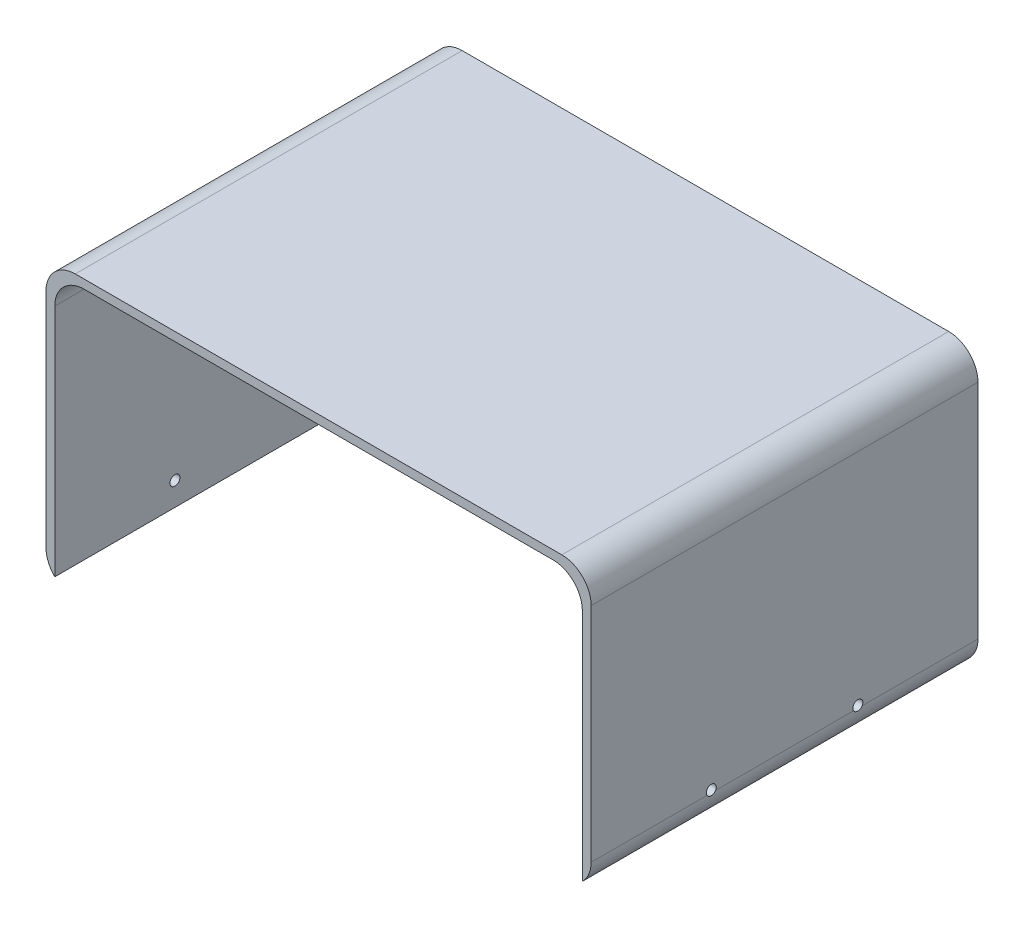
ISO-10303-21;
HEADER;
FILE_DESCRIPTION(('STEP AP214'),'2;1');
FILE_NAME('part.step','',(''),(''),'','','');
FILE_SCHEMA(('AUTOMOTIVE_DESIGN { 1 0 10303 214 1 1 1 1 }'));
ENDSEC;
DATA;
#1=APPLICATION_CONTEXT('core data for automotive mechanical design processes');
#2=APPLICATION_PROTOCOL_DEFINITION('international standard','automotive_design',2000,#1);
#3=PRODUCT_CONTEXT('',#1,'mechanical');
#4=PRODUCT('Part','Part','',(#3));
#5=PRODUCT_RELATED_PRODUCT_CATEGORY('part','',(#4));
#6=PRODUCT_DEFINITION_FORMATION('','',#4);
#7=PRODUCT_DEFINITION_CONTEXT('part definition',#1,'design');
#8=PRODUCT_DEFINITION('design','',#6,#7);
#9=PRODUCT_DEFINITION_SHAPE('','',#8);
#10=(LENGTH_UNIT() NAMED_UNIT(*) SI_UNIT(.MILLI.,.METRE.));
#11=(NAMED_UNIT(*) PLANE_ANGLE_UNIT() SI_UNIT($,.RADIAN.));
#12=(NAMED_UNIT(*) SI_UNIT($,.STERADIAN.) SOLID_ANGLE_UNIT());
#13=UNCERTAINTY_MEASURE_WITH_UNIT(LENGTH_MEASURE(1.E-05),#10,'distance_accuracy_value','');
#14=(GEOMETRIC_REPRESENTATION_CONTEXT(3) GLOBAL_UNCERTAINTY_ASSIGNED_CONTEXT((#13)) GLOBAL_UNIT_ASSIGNED_CONTEXT((#10,
#11,#12)) REPRESENTATION_CONTEXT('',''));
#15=CARTESIAN_POINT('',(0.,0.,0.));
#16=DIRECTION('',(0.,0.,1.));
#17=DIRECTION('',(1.,0.,0.));
#18=AXIS2_PLACEMENT_3D('',#15,#16,#17);
#19=CARTESIAN_POINT('',(0.,0.,0.));
#20=DIRECTION('',(1.,0.,0.));
#21=DIRECTION('',(0.,0.,-1.));
#22=AXIS2_PLACEMENT_3D('',#19,#20,#21);
#23=PLANE('',#22);
#24=CARTESIAN_POINT('',(0.,-85.,-91.));
#25=DIRECTION('',(1.,0.,0.));
#26=DIRECTION('',(0.,0.,-1.));
#27=AXIS2_PLACEMENT_3D('',#24,#25,#26);
#28=CIRCLE('',#27,1.70000000000001);
#29=CARTESIAN_POINT('',(0.,-85.,-92.7));
#30=VERTEX_POINT('',#29);
#31=EDGE_CURVE('E296',#30,#30,#28,.T.);
#32=ORIENTED_EDGE('',*,*,#31,.T.);
#33=EDGE_LOOP('',(#32));
#34=FACE_BOUND('',#33,.T.);
#35=CARTESIAN_POINT('',(0.,-85.,-41.));
#36=DIRECTION('',(1.,0.,0.));
#37=DIRECTION('',(0.,0.,-1.));
#38=AXIS2_PLACEMENT_3D('',#35,#36,#37);
#39=CIRCLE('',#38,1.7);
#40=CARTESIAN_POINT('',(0.,-85.,-42.7));
#41=VERTEX_POINT('',#40);
#42=EDGE_CURVE('E384',#41,#41,#39,.T.);
#43=ORIENTED_EDGE('',*,*,#42,.T.);
#44=EDGE_LOOP('',(#43));
#45=FACE_BOUND('',#44,.T.);
#46=DIRECTION('',(0.,-1.,0.));
#47=VECTOR('',#46,1.);
#48=CARTESIAN_POINT('',(0.,0.,0.));
#49=LINE('',#48,#47);
#50=CARTESIAN_POINT('',(0.,-13.,0.));
#51=VERTEX_POINT('',#50);
#52=CARTESIAN_POINT('',(0.,-93.,0.));
#53=VERTEX_POINT('',#52);
#54=EDGE_CURVE('E306',#51,#53,#49,.T.);
#55=ORIENTED_EDGE('',*,*,#54,.F.);
#56=DIRECTION('',(0.,0.,1.));
#57=VECTOR('',#56,1.);
#58=CARTESIAN_POINT('',(0.,-13.,-132.));
#59=LINE('',#58,#57);
#60=CARTESIAN_POINT('',(0.,-13.,-132.));
#61=VERTEX_POINT('',#60);
#62=EDGE_CURVE('E329',#51,#61,#59,.F.);
#63=ORIENTED_EDGE('',*,*,#62,.T.);
#64=DIRECTION('',(0.,1.,0.));
#65=VECTOR('',#64,1.);
#66=CARTESIAN_POINT('',(0.,0.,-132.));
#67=LINE('',#66,#65);
#68=CARTESIAN_POINT('',(0.,-93.,-132.));
#69=VERTEX_POINT('',#68);
#70=EDGE_CURVE('E311',#69,#61,#67,.T.);
#71=ORIENTED_EDGE('',*,*,#70,.F.);
#72=DIRECTION('',(0.,0.,-1.));
#73=VECTOR('',#72,1.);
#74=CARTESIAN_POINT('',(0.,-93.,0.));
#75=LINE('',#74,#73);
#76=EDGE_CURVE('E315',#53,#69,#75,.T.);
#77=ORIENTED_EDGE('',*,*,#76,.F.);
#78=EDGE_LOOP('',(#55,#63,#71,#77));
#79=FACE_BOUND('',#78,.T.);
#80=ADVANCED_FACE('F36',(#34,#45,#79),#23,.F.);
#81=CARTESIAN_POINT('',(3.,0.,0.));
#82=DIRECTION('',(0.,0.,-1.));
#83=DIRECTION('',(0.,1.,0.));
#84=AXIS2_PLACEMENT_3D('',#81,#82,#83);
#85=PLANE('',#84);
#86=ORIENTED_EDGE('',*,*,#54,.T.);
#87=CARTESIAN_POINT('',(-7.,-85.8585715714571,0.));
#88=DIRECTION('',(0.,0.,-1.));
#89=DIRECTION('',(0.,1.,0.));
#90=AXIS2_PLACEMENT_3D('',#87,#88,#89);
#91=CIRCLE('',#90,10.);
#92=CARTESIAN_POINT('',(3.,-85.8585715714571,0.));
#93=VERTEX_POINT('',#92);
#94=EDGE_CURVE('E173',#53,#93,#91,.F.);
#95=ORIENTED_EDGE('',*,*,#94,.T.);
#96=DIRECTION('',(0.,-1.,0.));
#97=VECTOR('',#96,1.);
#98=CARTESIAN_POINT('',(3.,0.,0.));
#99=LINE('',#98,#97);
#100=CARTESIAN_POINT('',(3.,-10.,0.));
#101=VERTEX_POINT('',#100);
#102=EDGE_CURVE('E307',#101,#93,#99,.T.);
#103=ORIENTED_EDGE('',*,*,#102,.F.);
#104=CARTESIAN_POINT('',(-7.,-10.,0.));
#105=DIRECTION('',(0.,0.,-1.));
#106=DIRECTION('',(0.,1.,0.));
#107=AXIS2_PLACEMENT_3D('',#104,#105,#106);
#108=CIRCLE('',#107,10.);
#109=CARTESIAN_POINT('',(-7.,0.,0.));
#110=VERTEX_POINT('',#109);
#111=EDGE_CURVE('E336',#101,#110,#108,.F.);
#112=ORIENTED_EDGE('',*,*,#111,.T.);
#113=DIRECTION('',(-1.,0.,0.));
#114=VECTOR('',#113,1.);
#115=CARTESIAN_POINT('',(3.,0.,0.));
#116=LINE('',#115,#114);
#117=CARTESIAN_POINT('',(-173.,0.,0.));
#118=VERTEX_POINT('',#117);
#119=EDGE_CURVE('E313',#110,#118,#116,.T.);
#120=ORIENTED_EDGE('',*,*,#119,.T.);
#121=CARTESIAN_POINT('',(-173.,-10.,0.));
#122=DIRECTION('',(0.,0.,-1.));
#123=DIRECTION('',(0.,1.,0.));
#124=AXIS2_PLACEMENT_3D('',#121,#122,#123);
#125=CIRCLE('',#124,10.);
#126=CARTESIAN_POINT('',(-183.,-10.,0.));
#127=VERTEX_POINT('',#126);
#128=EDGE_CURVE('E334',#118,#127,#125,.F.);
#129=ORIENTED_EDGE('',*,*,#128,.T.);
#130=DIRECTION('',(0.,1.,0.));
#131=VECTOR('',#130,1.);
#132=CARTESIAN_POINT('',(-183.,0.,0.));
#133=LINE('',#132,#131);
#134=CARTESIAN_POINT('',(-183.,-85.8585715714571,0.));
#135=VERTEX_POINT('',#134);
#136=EDGE_CURVE('E289',#135,#127,#133,.T.);
#137=ORIENTED_EDGE('',*,*,#136,.F.);
#138=CARTESIAN_POINT('',(-173.,-85.8585715714571,0.));
#139=DIRECTION('',(0.,0.,-1.));
#140=DIRECTION('',(0.,1.,0.));
#141=AXIS2_PLACEMENT_3D('',#138,#139,#140);
#142=CIRCLE('',#141,10.);
#143=CARTESIAN_POINT('',(-180.,-93.,0.));
#144=VERTEX_POINT('',#143);
#145=EDGE_CURVE('E171',#135,#144,#142,.F.);
#146=ORIENTED_EDGE('',*,*,#145,.T.);
#147=DIRECTION('',(0.,1.,0.));
#148=VECTOR('',#147,1.);
#149=CARTESIAN_POINT('',(-180.,0.,0.));
#150=LINE('',#149,#148);
#151=CARTESIAN_POINT('',(-180.,-13.,0.));
#152=VERTEX_POINT('',#151);
#153=EDGE_CURVE('E287',#144,#152,#150,.T.);
#154=ORIENTED_EDGE('',*,*,#153,.T.);
#155=CARTESIAN_POINT('',(-170.,-13.,0.));
#156=DIRECTION('',(0.,0.,-1.));
#157=DIRECTION('',(0.,1.,0.));
#158=AXIS2_PLACEMENT_3D('',#155,#156,#157);
#159=CIRCLE('',#158,10.);
#160=CARTESIAN_POINT('',(-170.,-3.,0.));
#161=VERTEX_POINT('',#160);
#162=EDGE_CURVE('E272',#152,#161,#159,.T.);
#163=ORIENTED_EDGE('',*,*,#162,.T.);
#164=DIRECTION('',(1.,0.,0.));
#165=VECTOR('',#164,1.);
#166=CARTESIAN_POINT('',(-180.,-3.,0.));
#167=LINE('',#166,#165);
#168=CARTESIAN_POINT('',(-10.0000000000001,-3.,0.));
#169=VERTEX_POINT('',#168);
#170=EDGE_CURVE('E300',#161,#169,#167,.T.);
#171=ORIENTED_EDGE('',*,*,#170,.T.);
#172=CARTESIAN_POINT('',(-10.,-13.,0.));
#173=DIRECTION('',(0.,0.,-1.));
#174=DIRECTION('',(0.,1.,0.));
#175=AXIS2_PLACEMENT_3D('',#172,#173,#174);
#176=CIRCLE('',#175,10.);
#177=EDGE_CURVE('E350',#169,#51,#176,.T.);
#178=ORIENTED_EDGE('',*,*,#177,.T.);
#179=EDGE_LOOP('',(#86,#95,#103,#112,#120,#129,#137,#146,#154,#163,#171,#178));
#180=FACE_BOUND('',#179,.T.);
#181=ADVANCED_FACE('F233',(#180),#85,.F.);
#182=CARTESIAN_POINT('',(3.,0.,-132.));
#183=DIRECTION('',(0.,0.,1.));
#184=DIRECTION('',(1.,0.,0.));
#185=AXIS2_PLACEMENT_3D('',#182,#183,#184);
#186=PLANE('',#185);
#187=DIRECTION('',(0.,1.,0.));
#188=VECTOR('',#187,1.);
#189=CARTESIAN_POINT('',(3.,0.,-132.));
#190=LINE('',#189,#188);
#191=CARTESIAN_POINT('',(3.,-85.8585715714571,-132.));
#192=VERTEX_POINT('',#191);
#193=CARTESIAN_POINT('',(3.,-10.,-132.));
#194=VERTEX_POINT('',#193);
#195=EDGE_CURVE('E310',#192,#194,#190,.T.);
#196=ORIENTED_EDGE('',*,*,#195,.F.);
#197=CARTESIAN_POINT('',(-7.,-85.8585715714571,-132.));
#198=DIRECTION('',(0.,0.,1.));
#199=DIRECTION('',(1.,0.,0.));
#200=AXIS2_PLACEMENT_3D('',#197,#198,#199);
#201=CIRCLE('',#200,10.);
#202=EDGE_CURVE('E283',#192,#69,#201,.F.);
#203=ORIENTED_EDGE('',*,*,#202,.T.);
#204=ORIENTED_EDGE('',*,*,#70,.T.);
#205=CARTESIAN_POINT('',(-10.,-13.,-132.));
#206=DIRECTION('',(0.,0.,1.));
#207=DIRECTION('',(1.,0.,0.));
#208=AXIS2_PLACEMENT_3D('',#205,#206,#207);
#209=CIRCLE('',#208,10.);
#210=CARTESIAN_POINT('',(-10.0000000000001,-3.,-132.));
#211=VERTEX_POINT('',#210);
#212=EDGE_CURVE('E277',#61,#211,#209,.T.);
#213=ORIENTED_EDGE('',*,*,#212,.T.);
#214=DIRECTION('',(1.,0.,0.));
#215=VECTOR('',#214,1.);
#216=CARTESIAN_POINT('',(-180.,-3.,-132.));
#217=LINE('',#216,#215);
#218=CARTESIAN_POINT('',(-170.,-3.,-132.));
#219=VERTEX_POINT('',#218);
#220=EDGE_CURVE('E303',#219,#211,#217,.T.);
#221=ORIENTED_EDGE('',*,*,#220,.F.);
#222=CARTESIAN_POINT('',(-170.,-13.,-132.));
#223=DIRECTION('',(0.,0.,1.));
#224=DIRECTION('',(1.,0.,0.));
#225=AXIS2_PLACEMENT_3D('',#222,#223,#224);
#226=CIRCLE('',#225,10.);
#227=CARTESIAN_POINT('',(-180.,-13.,-132.));
#228=VERTEX_POINT('',#227);
#229=EDGE_CURVE('E265',#219,#228,#226,.T.);
#230=ORIENTED_EDGE('',*,*,#229,.T.);
#231=DIRECTION('',(0.,-1.,0.));
#232=VECTOR('',#231,1.);
#233=CARTESIAN_POINT('',(-180.,0.,-132.));
#234=LINE('',#233,#232);
#235=CARTESIAN_POINT('',(-180.,-93.,-132.));
#236=VERTEX_POINT('',#235);
#237=EDGE_CURVE('E294',#228,#236,#234,.T.);
#238=ORIENTED_EDGE('',*,*,#237,.T.);
#239=CARTESIAN_POINT('',(-173.,-85.8585715714571,-132.));
#240=DIRECTION('',(0.,0.,1.));
#241=DIRECTION('',(1.,0.,0.));
#242=AXIS2_PLACEMENT_3D('',#239,#240,#241);
#243=CIRCLE('',#242,10.);
#244=CARTESIAN_POINT('',(-183.,-85.8585715714571,-132.));
#245=VERTEX_POINT('',#244);
#246=EDGE_CURVE('E184',#236,#245,#243,.F.);
#247=ORIENTED_EDGE('',*,*,#246,.T.);
#248=DIRECTION('',(0.,-1.,0.));
#249=VECTOR('',#248,1.);
#250=CARTESIAN_POINT('',(-183.,0.,-132.));
#251=LINE('',#250,#249);
#252=CARTESIAN_POINT('',(-183.,-10.,-132.));
#253=VERTEX_POINT('',#252);
#254=EDGE_CURVE('E182',#253,#245,#251,.T.);
#255=ORIENTED_EDGE('',*,*,#254,.F.);
#256=CARTESIAN_POINT('',(-173.,-10.,-132.));
#257=DIRECTION('',(0.,0.,1.));
#258=DIRECTION('',(1.,0.,0.));
#259=AXIS2_PLACEMENT_3D('',#256,#257,#258);
#260=CIRCLE('',#259,10.);
#261=CARTESIAN_POINT('',(-173.,0.,-132.));
#262=VERTEX_POINT('',#261);
#263=EDGE_CURVE('E342',#253,#262,#260,.F.);
#264=ORIENTED_EDGE('',*,*,#263,.T.);
#265=DIRECTION('',(-1.,0.,0.));
#266=VECTOR('',#265,1.);
#267=CARTESIAN_POINT('',(3.,0.,-132.));
#268=LINE('',#267,#266);
#269=CARTESIAN_POINT('',(-7.,0.,-132.));
#270=VERTEX_POINT('',#269);
#271=EDGE_CURVE('E322',#270,#262,#268,.T.);
#272=ORIENTED_EDGE('',*,*,#271,.F.);
#273=CARTESIAN_POINT('',(-7.,-10.,-132.));
#274=DIRECTION('',(0.,0.,1.));
#275=DIRECTION('',(1.,0.,0.));
#276=AXIS2_PLACEMENT_3D('',#273,#274,#275);
#277=CIRCLE('',#276,10.);
#278=EDGE_CURVE('E344',#270,#194,#277,.F.);
#279=ORIENTED_EDGE('',*,*,#278,.T.);
#280=EDGE_LOOP('',(#196,#203,#204,#213,#221,#230,#238,#247,#255,#264,#272,#279));
#281=FACE_BOUND('',#280,.T.);
#282=ADVANCED_FACE('F237',(#281),#186,.F.);
#283=CARTESIAN_POINT('',(3.,0.,0.));
#284=DIRECTION('',(0.,-1.,0.));
#285=DIRECTION('',(0.,0.,-1.));
#286=AXIS2_PLACEMENT_3D('',#283,#284,#285);
#287=PLANE('',#286);
#288=ORIENTED_EDGE('',*,*,#119,.F.);
#289=DIRECTION('',(0.,0.,1.));
#290=VECTOR('',#289,1.);
#291=CARTESIAN_POINT('',(-7.,0.,-132.));
#292=LINE('',#291,#290);
#293=EDGE_CURVE('E340',#110,#270,#292,.F.);
#294=ORIENTED_EDGE('',*,*,#293,.T.);
#295=ORIENTED_EDGE('',*,*,#271,.T.);
#296=DIRECTION('',(0.,0.,-1.));
#297=VECTOR('',#296,1.);
#298=CARTESIAN_POINT('',(-173.,0.,0.));
#299=LINE('',#298,#297);
#300=EDGE_CURVE('E338',#262,#118,#299,.F.);
#301=ORIENTED_EDGE('',*,*,#300,.T.);
#302=EDGE_LOOP('',(#288,#294,#295,#301));
#303=FACE_BOUND('',#302,.T.);
#304=ADVANCED_FACE('F229',(#303),#287,.F.);
#305=CARTESIAN_POINT('',(3.,0.,0.));
#306=DIRECTION('',(1.,0.,0.));
#307=DIRECTION('',(0.,0.,-1.));
#308=AXIS2_PLACEMENT_3D('',#305,#306,#307);
#309=PLANE('',#308);
#310=CARTESIAN_POINT('',(3.,-85.,-91.));
#311=DIRECTION('',(-1.,0.,0.));
#312=DIRECTION('',(0.,0.,1.));
#313=AXIS2_PLACEMENT_3D('',#310,#311,#312);
#314=CIRCLE('',#313,1.70000000000001);
#315=CARTESIAN_POINT('',(3.,-85.8585715714571,-89.5327389950368));
#316=VERTEX_POINT('',#315);
#317=CARTESIAN_POINT('',(3.,-85.8585715714571,-92.4672610049632));
#318=VERTEX_POINT('',#317);
#319=EDGE_CURVE('E56',#316,#318,#314,.T.);
#320=ORIENTED_EDGE('',*,*,#319,.T.);
#321=DIRECTION('',(0.,0.,1.));
#322=VECTOR('',#321,1.);
#323=CARTESIAN_POINT('',(3.,-85.8585715714571,-132.));
#324=LINE('',#323,#322);
#325=EDGE_CURVE('E271',#318,#192,#324,.F.);
#326=ORIENTED_EDGE('',*,*,#325,.T.);
#327=ORIENTED_EDGE('',*,*,#195,.T.);
#328=DIRECTION('',(0.,0.,1.));
#329=VECTOR('',#328,1.);
#330=CARTESIAN_POINT('',(3.,-10.,0.));
#331=LINE('',#330,#329);
#332=EDGE_CURVE('E331',#194,#101,#331,.T.);
#333=ORIENTED_EDGE('',*,*,#332,.T.);
#334=ORIENTED_EDGE('',*,*,#102,.T.);
#335=CARTESIAN_POINT('',(3.,-85.8585715714571,-39.5327389950368));
#336=VERTEX_POINT('',#335);
#337=EDGE_CURVE('E276',#93,#336,#324,.F.);
#338=ORIENTED_EDGE('',*,*,#337,.T.);
#339=CARTESIAN_POINT('',(3.,-85.,-41.));
#340=DIRECTION('',(-1.,0.,0.));
#341=DIRECTION('',(0.,0.,1.));
#342=AXIS2_PLACEMENT_3D('',#339,#340,#341);
#343=CIRCLE('',#342,1.7);
#344=CARTESIAN_POINT('',(3.,-85.8585715714571,-42.4672610049632));
#345=VERTEX_POINT('',#344);
#346=EDGE_CURVE('E63',#336,#345,#343,.T.);
#347=ORIENTED_EDGE('',*,*,#346,.T.);
#348=EDGE_CURVE('E274',#345,#316,#324,.F.);
#349=ORIENTED_EDGE('',*,*,#348,.T.);
#350=EDGE_LOOP('',(#320,#326,#327,#333,#334,#338,#347,#349));
#351=FACE_BOUND('',#350,.T.);
#352=ADVANCED_FACE('F225',(#351),#309,.T.);
#353=CARTESIAN_POINT('',(-180.,-3.,-132.));
#354=DIRECTION('',(0.,1.,0.));
#355=DIRECTION('',(0.,0.,1.));
#356=AXIS2_PLACEMENT_3D('',#353,#354,#355);
#357=PLANE('',#356);
#358=ORIENTED_EDGE('',*,*,#220,.T.);
#359=DIRECTION('',(0.,0.,1.));
#360=VECTOR('',#359,1.);
#361=CARTESIAN_POINT('',(-10.,-3.,0.));
#362=LINE('',#361,#360);
#363=EDGE_CURVE('E326',#211,#169,#362,.T.);
#364=ORIENTED_EDGE('',*,*,#363,.T.);
#365=ORIENTED_EDGE('',*,*,#170,.F.);
#366=DIRECTION('',(0.,0.,1.));
#367=VECTOR('',#366,1.);
#368=CARTESIAN_POINT('',(-170.,-3.,-132.));
#369=LINE('',#368,#367);
#370=EDGE_CURVE('E266',#161,#219,#369,.F.);
#371=ORIENTED_EDGE('',*,*,#370,.T.);
#372=EDGE_LOOP('',(#358,#364,#365,#371));
#373=FACE_BOUND('',#372,.T.);
#374=ADVANCED_FACE('F221',(#373),#357,.F.);
#375=CARTESIAN_POINT('',(-180.,0.,0.));
#376=DIRECTION('',(-1.,0.,0.));
#377=DIRECTION('',(0.,0.,1.));
#378=AXIS2_PLACEMENT_3D('',#375,#376,#377);
#379=PLANE('',#378);
#380=CARTESIAN_POINT('',(-180.,-85.,-91.));
#381=DIRECTION('',(-1.,0.,0.));
#382=DIRECTION('',(0.,0.,1.));
#383=AXIS2_PLACEMENT_3D('',#380,#381,#382);
#384=CIRCLE('',#383,1.70000000000001);
#385=CARTESIAN_POINT('',(-180.,-85.,-89.3));
#386=VERTEX_POINT('',#385);
#387=EDGE_CURVE('E376',#386,#386,#384,.T.);
#388=ORIENTED_EDGE('',*,*,#387,.T.);
#389=EDGE_LOOP('',(#388));
#390=FACE_BOUND('',#389,.T.);
#391=CARTESIAN_POINT('',(-180.,-85.,-41.));
#392=DIRECTION('',(-1.,0.,0.));
#393=DIRECTION('',(0.,0.,1.));
#394=AXIS2_PLACEMENT_3D('',#391,#392,#393);
#395=CIRCLE('',#394,1.7);
#396=CARTESIAN_POINT('',(-180.,-85.,-39.3));
#397=VERTEX_POINT('',#396);
#398=EDGE_CURVE('E199',#397,#397,#395,.T.);
#399=ORIENTED_EDGE('',*,*,#398,.T.);
#400=EDGE_LOOP('',(#399));
#401=FACE_BOUND('',#400,.T.);
#402=ORIENTED_EDGE('',*,*,#237,.F.);
#403=DIRECTION('',(0.,0.,1.));
#404=VECTOR('',#403,1.);
#405=CARTESIAN_POINT('',(-180.,-13.,0.));
#406=LINE('',#405,#404);
#407=EDGE_CURVE('E268',#228,#152,#406,.T.);
#408=ORIENTED_EDGE('',*,*,#407,.T.);
#409=ORIENTED_EDGE('',*,*,#153,.F.);
#410=DIRECTION('',(0.,0.,1.));
#411=VECTOR('',#410,1.);
#412=CARTESIAN_POINT('',(-180.,-93.,-132.));
#413=LINE('',#412,#411);
#414=EDGE_CURVE('E292',#236,#144,#413,.T.);
#415=ORIENTED_EDGE('',*,*,#414,.F.);
#416=EDGE_LOOP('',(#402,#408,#409,#415));
#417=FACE_BOUND('',#416,.T.);
#418=ADVANCED_FACE('F218',(#390,#401,#417),#379,.F.);
#419=CARTESIAN_POINT('',(-183.,0.,0.));
#420=DIRECTION('',(-1.,0.,0.));
#421=DIRECTION('',(0.,0.,1.));
#422=AXIS2_PLACEMENT_3D('',#419,#420,#421);
#423=PLANE('',#422);
#424=CARTESIAN_POINT('',(-183.,-85.,-91.));
#425=DIRECTION('',(-1.,0.,0.));
#426=DIRECTION('',(0.,0.,1.));
#427=AXIS2_PLACEMENT_3D('',#424,#425,#426);
#428=CIRCLE('',#427,1.70000000000001);
#429=CARTESIAN_POINT('',(-183.,-85.8585715714571,-89.5327389950368));
#430=VERTEX_POINT('',#429);
#431=CARTESIAN_POINT('',(-183.,-85.8585715714571,-92.4672610049632));
#432=VERTEX_POINT('',#431);
#433=EDGE_CURVE('E179',#430,#432,#428,.T.);
#434=ORIENTED_EDGE('',*,*,#433,.F.);
#435=DIRECTION('',(0.,0.,-1.));
#436=VECTOR('',#435,1.);
#437=CARTESIAN_POINT('',(-183.,-85.8585715714571,0.));
#438=LINE('',#437,#436);
#439=CARTESIAN_POINT('',(-183.,-85.8585715714571,-42.4672610049632));
#440=VERTEX_POINT('',#439);
#441=EDGE_CURVE('E167',#430,#440,#438,.F.);
#442=ORIENTED_EDGE('',*,*,#441,.T.);
#443=CARTESIAN_POINT('',(-183.,-85.,-41.));
#444=DIRECTION('',(-1.,0.,0.));
#445=DIRECTION('',(0.,0.,1.));
#446=AXIS2_PLACEMENT_3D('',#443,#444,#445);
#447=CIRCLE('',#446,1.7);
#448=CARTESIAN_POINT('',(-183.,-85.8585715714571,-39.5327389950368));
#449=VERTEX_POINT('',#448);
#450=EDGE_CURVE('E156',#449,#440,#447,.T.);
#451=ORIENTED_EDGE('',*,*,#450,.F.);
#452=EDGE_CURVE('E165',#449,#135,#438,.F.);
#453=ORIENTED_EDGE('',*,*,#452,.T.);
#454=ORIENTED_EDGE('',*,*,#136,.T.);
#455=DIRECTION('',(0.,0.,-1.));
#456=VECTOR('',#455,1.);
#457=CARTESIAN_POINT('',(-183.,-10.,-132.));
#458=LINE('',#457,#456);
#459=EDGE_CURVE('E347',#127,#253,#458,.T.);
#460=ORIENTED_EDGE('',*,*,#459,.T.);
#461=ORIENTED_EDGE('',*,*,#254,.T.);
#462=EDGE_CURVE('E161',#245,#432,#438,.F.);
#463=ORIENTED_EDGE('',*,*,#462,.T.);
#464=EDGE_LOOP('',(#434,#442,#451,#453,#454,#460,#461,#463));
#465=FACE_BOUND('',#464,.T.);
#466=ADVANCED_FACE('F164',(#465),#423,.T.);
#467=CARTESIAN_POINT('',(-10.,-13.,-132.));
#468=DIRECTION('',(0.,0.,-1.));
#469=DIRECTION('',(-1.,0.,0.));
#470=AXIS2_PLACEMENT_3D('',#467,#468,#469);
#471=CYLINDRICAL_SURFACE('',#470,10.);
#472=ORIENTED_EDGE('',*,*,#212,.F.);
#473=ORIENTED_EDGE('',*,*,#62,.F.);
#474=ORIENTED_EDGE('',*,*,#177,.F.);
#475=ORIENTED_EDGE('',*,*,#363,.F.);
#476=EDGE_LOOP('',(#472,#473,#474,#475));
#477=FACE_BOUND('',#476,.T.);
#478=ADVANCED_FACE('F217',(#477),#471,.F.);
#479=CARTESIAN_POINT('',(-7.,-10.,0.));
#480=DIRECTION('',(0.,0.,-1.));
#481=DIRECTION('',(-1.,0.,0.));
#482=AXIS2_PLACEMENT_3D('',#479,#480,#481);
#483=CYLINDRICAL_SURFACE('',#482,10.);
#484=ORIENTED_EDGE('',*,*,#278,.F.);
#485=ORIENTED_EDGE('',*,*,#293,.F.);
#486=ORIENTED_EDGE('',*,*,#111,.F.);
#487=ORIENTED_EDGE('',*,*,#332,.F.);
#488=EDGE_LOOP('',(#484,#485,#486,#487));
#489=FACE_BOUND('',#488,.T.);
#490=ADVANCED_FACE('F247',(#489),#483,.T.);
#491=CARTESIAN_POINT('',(-173.,-10.,0.));
#492=DIRECTION('',(0.,0.,1.));
#493=DIRECTION('',(1.,0.,0.));
#494=AXIS2_PLACEMENT_3D('',#491,#492,#493);
#495=CYLINDRICAL_SURFACE('',#494,10.);
#496=ORIENTED_EDGE('',*,*,#128,.F.);
#497=ORIENTED_EDGE('',*,*,#300,.F.);
#498=ORIENTED_EDGE('',*,*,#263,.F.);
#499=ORIENTED_EDGE('',*,*,#459,.F.);
#500=EDGE_LOOP('',(#496,#497,#498,#499));
#501=FACE_BOUND('',#500,.T.);
#502=ADVANCED_FACE('F251',(#501),#495,.T.);
#503=CARTESIAN_POINT('',(-170.,-13.,0.));
#504=DIRECTION('',(0.,0.,-1.));
#505=DIRECTION('',(-1.,0.,0.));
#506=AXIS2_PLACEMENT_3D('',#503,#504,#505);
#507=CYLINDRICAL_SURFACE('',#506,10.);
#508=ORIENTED_EDGE('',*,*,#229,.F.);
#509=ORIENTED_EDGE('',*,*,#370,.F.);
#510=ORIENTED_EDGE('',*,*,#162,.F.);
#511=ORIENTED_EDGE('',*,*,#407,.F.);
#512=EDGE_LOOP('',(#508,#509,#510,#511));
#513=FACE_BOUND('',#512,.T.);
#514=ADVANCED_FACE('F254',(#513),#507,.F.);
#515=CARTESIAN_POINT('',(-7.,-85.8585715714571,0.));
#516=DIRECTION('',(0.,0.,-1.));
#517=DIRECTION('',(-1.,0.,0.));
#518=AXIS2_PLACEMENT_3D('',#515,#516,#517);
#519=CYLINDRICAL_SURFACE('',#518,10.);
#520=CARTESIAN_POINT('',(3.,-85.8585715714571,-89.5327389950368));
#521=CARTESIAN_POINT('',(3.00000089570893,-85.8997927449305,-89.5568598354492));
#522=CARTESIAN_POINT('',(2.99974498229115,-85.9399765082869,-89.5827066332226));
#523=CARTESIAN_POINT('',(2.99880467980365,-86.0180222240946,-89.6376817097996));
#524=CARTESIAN_POINT('',(2.99812032952581,-86.0558843864093,-89.6668096913197));
#525=CARTESIAN_POINT('',(2.99555515920776,-86.1655039560258,-89.7587619597002));
#526=CARTESIAN_POINT('',(2.99316163896259,-86.2334369830711,-89.8262381794561));
#527=CARTESIAN_POINT('',(2.98776263754733,-86.3570131329096,-89.9715883020636));
#528=CARTESIAN_POINT('',(2.98475696828935,-86.4126524673816,-90.0494653981333));
#529=CARTESIAN_POINT('',(2.97887239664383,-86.5101036225068,-90.2134402345812));
#530=CARTESIAN_POINT('',(2.97599347566404,-86.551917477068,-90.2995367633698));
#531=CARTESIAN_POINT('',(2.97098176579202,-86.6206220964525,-90.4777642870097));
#532=CARTESIAN_POINT('',(2.96885090003041,-86.6474745002168,-90.5699101229501));
#533=CARTESIAN_POINT('',(2.96578383635948,-86.6853226679817,-90.7574361507262));
#534=CARTESIAN_POINT('',(2.96484778359239,-86.6963165055534,-90.8528167340648));
#535=CARTESIAN_POINT('',(2.96435899297879,-86.7021110432467,-91.0437894909121));
#536=CARTESIAN_POINT('',(2.96480218359736,-86.6969594045957,-91.1393802107974));
#537=CARTESIAN_POINT('',(2.96697479887444,-86.670718910623,-91.3283192284043));
#538=CARTESIAN_POINT('',(2.96870404486933,-86.6496322690449,-91.4216678357491));
#539=CARTESIAN_POINT('',(2.97309747735087,-86.5921590495748,-91.6034121862539));
#540=CARTESIAN_POINT('',(2.97576083340129,-86.5557860557765,-91.6918122480557));
#541=CARTESIAN_POINT('',(2.98146181026231,-86.4687454534518,-91.8613165778539));
#542=CARTESIAN_POINT('',(2.98449962251873,-86.4180705156462,-91.9424170768836));
#543=CARTESIAN_POINT('',(2.99025615410322,-86.3036280996539,-92.095316189175));
#544=CARTESIAN_POINT('',(2.99297348568609,-86.2398067484759,-92.1670744786519));
#545=CARTESIAN_POINT('',(2.99729766467933,-86.101082772641,-92.2987390528019));
#546=CARTESIAN_POINT('',(2.99890683413325,-86.0262037208691,-92.3586699313572));
#547=CARTESIAN_POINT('',(2.99986581557478,-85.9180330735512,-92.4312367654526));
#548=CARTESIAN_POINT('',(3.00000162169652,-85.8885663751344,-92.4497179093341));
#549=CARTESIAN_POINT('',(3.,-85.8585715714571,-92.4672610049632));
#550=B_SPLINE_CURVE_WITH_KNOTS('',3,(#520,#521,#522,#523,#524,#525,#526,#527,#528,#529,#530,
#531,#532,#533,#534,#535,#536,#537,#538,#539,#540,#541,#542,#543,#544,#545,#546,#547,#548,#549),
.UNSPECIFIED.,.F.,.F.,(4,2,2,2,2,2,2,2,2,2,2,2,2,2,4),(0.,0.143189742027451,0.286366521125266,
0.572230674877826,0.858182795651776,1.14409283041006,1.43073260226336,1.71740719092463,
2.00323631802855,2.28902574409961,2.57456174091714,2.86024433214221,3.14712178885103,
3.43339627819377,3.53767361695446),.UNSPECIFIED.);
#551=EDGE_CURVE('E379',#316,#318,#550,.T.);
#552=ORIENTED_EDGE('',*,*,#551,.F.);
#553=ORIENTED_EDGE('',*,*,#348,.F.);
#554=CARTESIAN_POINT('',(3.,-85.8585715714571,-39.5327389950368));
#555=CARTESIAN_POINT('',(3.00000089570893,-85.8997927449305,-39.5568598354492));
#556=CARTESIAN_POINT('',(2.99974498229115,-85.9399765082869,-39.5827066332226));
#557=CARTESIAN_POINT('',(2.99880467980365,-86.0180222240946,-39.6376817097996));
#558=CARTESIAN_POINT('',(2.99812032952581,-86.0558843864093,-39.6668096913197));
#559=CARTESIAN_POINT('',(2.99555515920776,-86.1655039560258,-39.7587619597002));
#560=CARTESIAN_POINT('',(2.99316163896258,-86.2334369830711,-39.8262381794562));
#561=CARTESIAN_POINT('',(2.98776263754733,-86.3570131329096,-39.9715883020636));
#562=CARTESIAN_POINT('',(2.98475696828935,-86.4126524673816,-40.0494653981333));
#563=CARTESIAN_POINT('',(2.97887239664383,-86.5101036225068,-40.2134402345812));
#564=CARTESIAN_POINT('',(2.97599347566404,-86.551917477068,-40.2995367633698));
#565=CARTESIAN_POINT('',(2.97098176579202,-86.6206220964525,-40.4777642870098));
#566=CARTESIAN_POINT('',(2.96885090003041,-86.6474745002168,-40.5699101229501));
#567=CARTESIAN_POINT('',(2.96578383635948,-86.6853226679817,-40.7574361507262));
#568=CARTESIAN_POINT('',(2.96484778359239,-86.6963165055534,-40.8528167340648));
#569=CARTESIAN_POINT('',(2.96435899297879,-86.7021110432467,-41.0437894909121));
#570=CARTESIAN_POINT('',(2.96480218359736,-86.6969594045956,-41.1393802107974));
#571=CARTESIAN_POINT('',(2.96697479887444,-86.670718910623,-41.3283192284043));
#572=CARTESIAN_POINT('',(2.96870404486933,-86.6496322690449,-41.4216678357491));
#573=CARTESIAN_POINT('',(2.97309747735087,-86.5921590495748,-41.6034121862539));
#574=CARTESIAN_POINT('',(2.97576083340129,-86.5557860557764,-41.6918122480557));
#575=CARTESIAN_POINT('',(2.98146181026231,-86.4687454534518,-41.8613165778539));
#576=CARTESIAN_POINT('',(2.98449962251873,-86.4180705156462,-41.9424170768836));
#577=CARTESIAN_POINT('',(2.99025615410322,-86.3036280996539,-42.095316189175));
#578=CARTESIAN_POINT('',(2.99297348568609,-86.2398067484759,-42.1670744786519));
#579=CARTESIAN_POINT('',(2.99729766467933,-86.101082772641,-42.2987390528019));
#580=CARTESIAN_POINT('',(2.99890683413325,-86.026203720869,-42.3586699313572));
#581=CARTESIAN_POINT('',(2.99986581557478,-85.9180330735512,-42.4312367654526));
#582=CARTESIAN_POINT('',(3.00000162169652,-85.8885663751344,-42.4497179093341));
#583=CARTESIAN_POINT('',(3.,-85.8585715714571,-42.4672610049632));
#584=B_SPLINE_CURVE_WITH_KNOTS('',3,(#554,#555,#556,#557,#558,#559,#560,#561,#562,#563,#564,
#565,#566,#567,#568,#569,#570,#571,#572,#573,#574,#575,#576,#577,#578,#579,#580,#581,#582,#583),
.UNSPECIFIED.,.F.,.F.,(4,2,2,2,2,2,2,2,2,2,2,2,2,2,4),(0.,0.143189742027435,0.286366521125266,
0.572230674877826,0.858182795651776,1.14409283041004,1.43073260226333,1.71740719092461,
2.00323631802854,2.28902574409958,2.57456174091711,2.86024433214218,3.147121788851,
3.43339627819373,3.53767361695441),.UNSPECIFIED.);
#585=EDGE_CURVE('E189',#336,#345,#584,.T.);
#586=ORIENTED_EDGE('',*,*,#585,.F.);
#587=ORIENTED_EDGE('',*,*,#337,.F.);
#588=ORIENTED_EDGE('',*,*,#94,.F.);
#589=ORIENTED_EDGE('',*,*,#76,.T.);
#590=ORIENTED_EDGE('',*,*,#202,.F.);
#591=ORIENTED_EDGE('',*,*,#325,.F.);
#592=EDGE_LOOP('',(#552,#553,#586,#587,#588,#589,#590,#591));
#593=FACE_BOUND('',#592,.T.);
#594=ADVANCED_FACE('F201',(#593),#519,.T.);
#595=CARTESIAN_POINT('',(-173.,-85.8585715714571,-132.));
#596=DIRECTION('',(0.,0.,1.));
#597=DIRECTION('',(1.,0.,0.));
#598=AXIS2_PLACEMENT_3D('',#595,#596,#597);
#599=CYLINDRICAL_SURFACE('',#598,10.);
#600=CARTESIAN_POINT('',(-183.,-85.8585715714571,-92.4672610049632));
#601=CARTESIAN_POINT('',(-183.000000895709,-85.8997927449305,-92.4431401645508));
#602=CARTESIAN_POINT('',(-182.999744982291,-85.9399765082869,-92.4172933667774));
#603=CARTESIAN_POINT('',(-182.998804679804,-86.0180222240946,-92.3623182902004));
#604=CARTESIAN_POINT('',(-182.998120329526,-86.0558843864093,-92.3331903086803));
#605=CARTESIAN_POINT('',(-182.995555159208,-86.1655039560258,-92.2412380402998));
#606=CARTESIAN_POINT('',(-182.993161638963,-86.2334369830711,-92.1737618205438));
#607=CARTESIAN_POINT('',(-182.987762637547,-86.3570131329096,-92.0284116979364));
#608=CARTESIAN_POINT('',(-182.984756968289,-86.4126524673816,-91.9505346018667));
#609=CARTESIAN_POINT('',(-182.978872396644,-86.5101036225068,-91.7865597654188));
#610=CARTESIAN_POINT('',(-182.975993475664,-86.551917477068,-91.7004632366302));
#611=CARTESIAN_POINT('',(-182.970981765792,-86.6206220964525,-91.5222357129902));
#612=CARTESIAN_POINT('',(-182.96885090003,-86.6474745002168,-91.4300898770499));
#613=CARTESIAN_POINT('',(-182.965783836359,-86.6853226679817,-91.2425638492738));
#614=CARTESIAN_POINT('',(-182.964847783592,-86.6963165055534,-91.1471832659352));
#615=CARTESIAN_POINT('',(-182.964358992979,-86.7021110432467,-90.9562105090879));
#616=CARTESIAN_POINT('',(-182.964802183597,-86.6969594045957,-90.8606197892026));
#617=CARTESIAN_POINT('',(-182.966974798874,-86.670718910623,-90.6716807715957));
#618=CARTESIAN_POINT('',(-182.968704044869,-86.6496322690449,-90.5783321642509));
#619=CARTESIAN_POINT('',(-182.973097477351,-86.5921590495748,-90.3965878137461));
#620=CARTESIAN_POINT('',(-182.975760833401,-86.5557860557765,-90.3081877519443));
#621=CARTESIAN_POINT('',(-182.981461810262,-86.4687454534518,-90.1386834221461));
#622=CARTESIAN_POINT('',(-182.984499622519,-86.4180705156462,-90.0575829231164));
#623=CARTESIAN_POINT('',(-182.990256154103,-86.3036280996539,-89.904683810825));
#624=CARTESIAN_POINT('',(-182.992973485686,-86.2398067484759,-89.8329255213481));
#625=CARTESIAN_POINT('',(-182.997297664679,-86.101082772641,-89.7012609471981));
#626=CARTESIAN_POINT('',(-182.998906834133,-86.0262037208691,-89.6413300686428));
#627=CARTESIAN_POINT('',(-182.999865815575,-85.9180330735512,-89.5687632345474));
#628=CARTESIAN_POINT('',(-183.000001621697,-85.8885663751344,-89.5502820906659));
#629=CARTESIAN_POINT('',(-183.,-85.8585715714571,-89.5327389950368));
#630=B_SPLINE_CURVE_WITH_KNOTS('',3,(#600,#601,#602,#603,#604,#605,#606,#607,#608,#609,#610,
#611,#612,#613,#614,#615,#616,#617,#618,#619,#620,#621,#622,#623,#624,#625,#626,#627,#628,#629),
.UNSPECIFIED.,.F.,.F.,(4,2,2,2,2,2,2,2,2,2,2,2,2,2,4),(0.,0.143189742027439,0.286366521125266,
0.572230674877826,0.858182795651775,1.14409283041006,1.43073260226335,1.71740719092463,
2.00323631802855,2.28902574409961,2.57456174091713,2.86024433214221,3.14712178885103,
3.43339627819377,3.53767361695446),.UNSPECIFIED.);
#631=EDGE_CURVE('E11',#432,#430,#630,.T.);
#632=ORIENTED_EDGE('',*,*,#631,.F.);
#633=ORIENTED_EDGE('',*,*,#462,.F.);
#634=ORIENTED_EDGE('',*,*,#246,.F.);
#635=ORIENTED_EDGE('',*,*,#414,.T.);
#636=ORIENTED_EDGE('',*,*,#145,.F.);
#637=ORIENTED_EDGE('',*,*,#452,.F.);
#638=CARTESIAN_POINT('',(-183.,-85.8585715714571,-42.4672610049632));
#639=CARTESIAN_POINT('',(-183.000000895709,-85.8997927449305,-42.4431401645508));
#640=CARTESIAN_POINT('',(-182.999744982291,-85.9399765082869,-42.4172933667774));
#641=CARTESIAN_POINT('',(-182.998804679804,-86.0180222240946,-42.3623182902004));
#642=CARTESIAN_POINT('',(-182.998120329526,-86.0558843864093,-42.3331903086803));
#643=CARTESIAN_POINT('',(-182.995555159208,-86.1655039560258,-42.2412380402998));
#644=CARTESIAN_POINT('',(-182.993161638963,-86.2334369830711,-42.1737618205438));
#645=CARTESIAN_POINT('',(-182.987762637547,-86.3570131329096,-42.0284116979364));
#646=CARTESIAN_POINT('',(-182.984756968289,-86.4126524673816,-41.9505346018666));
#647=CARTESIAN_POINT('',(-182.978872396644,-86.5101036225068,-41.7865597654188));
#648=CARTESIAN_POINT('',(-182.975993475664,-86.551917477068,-41.7004632366301));
#649=CARTESIAN_POINT('',(-182.970981765792,-86.6206220964525,-41.5222357129902));
#650=CARTESIAN_POINT('',(-182.96885090003,-86.6474745002168,-41.4300898770499));
#651=CARTESIAN_POINT('',(-182.965783836359,-86.6853226679817,-41.2425638492738));
#652=CARTESIAN_POINT('',(-182.964847783592,-86.6963165055534,-41.1471832659352));
#653=CARTESIAN_POINT('',(-182.964358992979,-86.7021110432467,-40.9562105090879));
#654=CARTESIAN_POINT('',(-182.964802183597,-86.6969594045956,-40.8606197892025));
#655=CARTESIAN_POINT('',(-182.966974798874,-86.670718910623,-40.6716807715957));
#656=CARTESIAN_POINT('',(-182.968704044869,-86.6496322690449,-40.5783321642509));
#657=CARTESIAN_POINT('',(-182.973097477351,-86.5921590495748,-40.3965878137461));
#658=CARTESIAN_POINT('',(-182.975760833401,-86.5557860557764,-40.3081877519443));
#659=CARTESIAN_POINT('',(-182.981461810262,-86.4687454534518,-40.1386834221461));
#660=CARTESIAN_POINT('',(-182.984499622519,-86.4180705156462,-40.0575829231164));
#661=CARTESIAN_POINT('',(-182.990256154103,-86.3036280996539,-39.904683810825));
#662=CARTESIAN_POINT('',(-182.992973485686,-86.2398067484759,-39.8329255213481));
#663=CARTESIAN_POINT('',(-182.997297664679,-86.101082772641,-39.7012609471981));
#664=CARTESIAN_POINT('',(-182.998906834133,-86.026203720869,-39.6413300686428));
#665=CARTESIAN_POINT('',(-182.999865815575,-85.9180330735512,-39.5687632345474));
#666=CARTESIAN_POINT('',(-183.000001621697,-85.8885663751344,-39.5502820906659));
#667=CARTESIAN_POINT('',(-183.,-85.8585715714571,-39.5327389950368));
#668=B_SPLINE_CURVE_WITH_KNOTS('',3,(#638,#639,#640,#641,#642,#643,#644,#645,#646,#647,#648,
#649,#650,#651,#652,#653,#654,#655,#656,#657,#658,#659,#660,#661,#662,#663,#664,#665,#666,#667),
.UNSPECIFIED.,.F.,.F.,(4,2,2,2,2,2,2,2,2,2,2,2,2,2,4),(0.,0.143189742027439,0.28636652112527,
0.572230674877835,0.858182795651784,1.14409283041006,1.43073260226336,1.71740719092462,
2.00323631802855,2.28902574409959,2.57456174091711,2.86024433214218,3.147121788851,
3.43339627819375,3.53767361695441),.UNSPECIFIED.);
#669=EDGE_CURVE('E50',#440,#449,#668,.T.);
#670=ORIENTED_EDGE('',*,*,#669,.F.);
#671=ORIENTED_EDGE('',*,*,#441,.F.);
#672=EDGE_LOOP('',(#632,#633,#634,#635,#636,#637,#670,#671));
#673=FACE_BOUND('',#672,.T.);
#674=ADVANCED_FACE('F38',(#673),#599,.T.);
#675=CARTESIAN_POINT('',(3.,-85.,-41.));
#676=DIRECTION('',(-1.,0.,0.));
#677=DIRECTION('',(0.,0.,1.));
#678=AXIS2_PLACEMENT_3D('',#675,#676,#677);
#679=CYLINDRICAL_SURFACE('',#678,1.7);
#680=ORIENTED_EDGE('',*,*,#669,.T.);
#681=ORIENTED_EDGE('',*,*,#450,.T.);
#682=EDGE_LOOP('',(#680,#681));
#683=FACE_BOUND('',#682,.T.);
#684=ORIENTED_EDGE('',*,*,#398,.F.);
#685=EDGE_LOOP('',(#684));
#686=FACE_BOUND('',#685,.T.);
#687=ADVANCED_FACE('F154',(#683,#686),#679,.F.);
#688=CARTESIAN_POINT('',(3.,-85.,-91.));
#689=DIRECTION('',(-1.,0.,0.));
#690=DIRECTION('',(0.,0.,1.));
#691=AXIS2_PLACEMENT_3D('',#688,#689,#690);
#692=CYLINDRICAL_SURFACE('',#691,1.70000000000001);
#693=ORIENTED_EDGE('',*,*,#631,.T.);
#694=ORIENTED_EDGE('',*,*,#433,.T.);
#695=EDGE_LOOP('',(#693,#694));
#696=FACE_BOUND('',#695,.T.);
#697=ORIENTED_EDGE('',*,*,#387,.F.);
#698=EDGE_LOOP('',(#697));
#699=FACE_BOUND('',#698,.T.);
#700=ADVANCED_FACE('F186',(#696,#699),#692,.F.);
#701=ORIENTED_EDGE('',*,*,#585,.T.);
#702=ORIENTED_EDGE('',*,*,#346,.F.);
#703=EDGE_LOOP('',(#701,#702));
#704=FACE_BOUND('',#703,.T.);
#705=ORIENTED_EDGE('',*,*,#42,.F.);
#706=EDGE_LOOP('',(#705));
#707=FACE_BOUND('',#706,.T.);
#708=ADVANCED_FACE('F204',(#704,#707),#679,.F.);
#709=ORIENTED_EDGE('',*,*,#551,.T.);
#710=ORIENTED_EDGE('',*,*,#319,.F.);
#711=EDGE_LOOP('',(#709,#710));
#712=FACE_BOUND('',#711,.T.);
#713=ORIENTED_EDGE('',*,*,#31,.F.);
#714=EDGE_LOOP('',(#713));
#715=FACE_BOUND('',#714,.T.);
#716=ADVANCED_FACE('F208',(#712,#715),#692,.F.);
#717=CLOSED_SHELL('',(#80,#181,#282,#304,#352,#374,#418,#466,#478,#490,#502,#514,#594,#674,#687,
#700,#708,#716));
#718=MANIFOLD_SOLID_BREP('B2',#717);
#719=ADVANCED_BREP_SHAPE_REPRESENTATION('',(#18,#718),#14);
#720=SHAPE_DEFINITION_REPRESENTATION(#9,#719);
ENDSEC;
END-ISO-10303-21;
